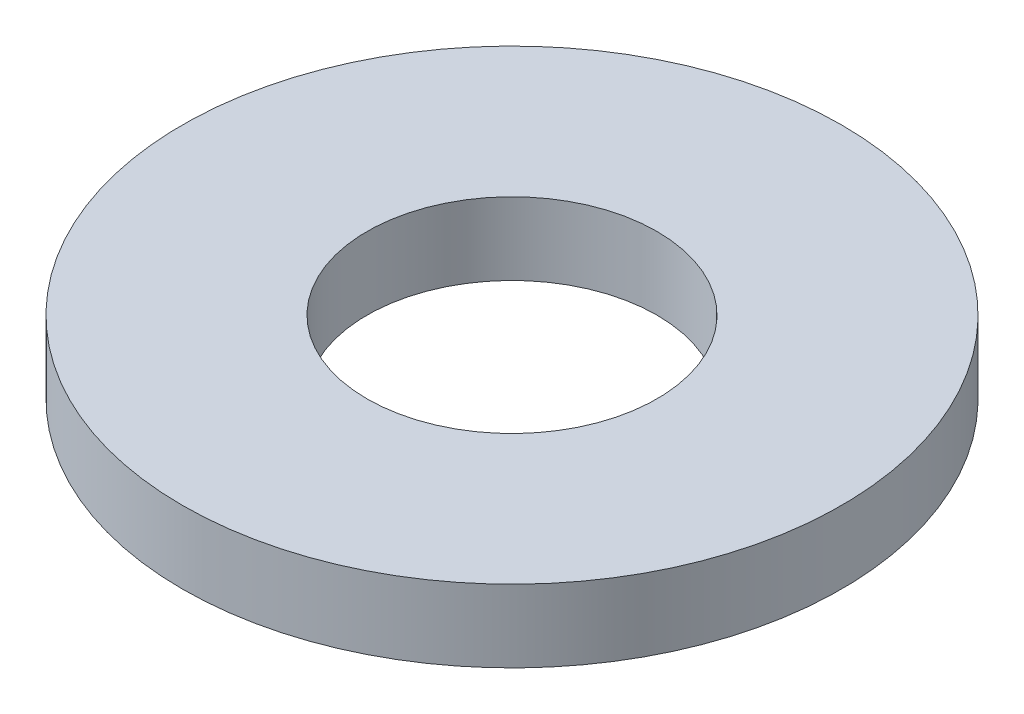
ISO-10303-21;
HEADER;
FILE_DESCRIPTION(('STEP AP214'),'2;1');
FILE_NAME('part.step','',(''),(''),'','','');
FILE_SCHEMA(('AUTOMOTIVE_DESIGN { 1 0 10303 214 1 1 1 1 }'));
ENDSEC;
DATA;
#1=APPLICATION_CONTEXT('core data for automotive mechanical design processes');
#2=APPLICATION_PROTOCOL_DEFINITION('international standard','automotive_design',2000,#1);
#3=PRODUCT_CONTEXT('',#1,'mechanical');
#4=PRODUCT('Part','Part','',(#3));
#5=PRODUCT_RELATED_PRODUCT_CATEGORY('part','',(#4));
#6=PRODUCT_DEFINITION_FORMATION('','',#4);
#7=PRODUCT_DEFINITION_CONTEXT('part definition',#1,'design');
#8=PRODUCT_DEFINITION('design','',#6,#7);
#9=PRODUCT_DEFINITION_SHAPE('','',#8);
#10=(LENGTH_UNIT() NAMED_UNIT(*) SI_UNIT(.MILLI.,.METRE.));
#11=(NAMED_UNIT(*) PLANE_ANGLE_UNIT() SI_UNIT($,.RADIAN.));
#12=(NAMED_UNIT(*) SI_UNIT($,.STERADIAN.) SOLID_ANGLE_UNIT());
#13=UNCERTAINTY_MEASURE_WITH_UNIT(LENGTH_MEASURE(1.E-05),#10,'distance_accuracy_value','');
#14=(GEOMETRIC_REPRESENTATION_CONTEXT(3) GLOBAL_UNCERTAINTY_ASSIGNED_CONTEXT((#13)) GLOBAL_UNIT_ASSIGNED_CONTEXT((#10,
#11,#12)) REPRESENTATION_CONTEXT('',''));
#15=CARTESIAN_POINT('',(0.,0.,0.));
#16=DIRECTION('',(0.,0.,1.));
#17=DIRECTION('',(1.,0.,0.));
#18=AXIS2_PLACEMENT_3D('',#15,#16,#17);
#19=CARTESIAN_POINT('',(0.,0.55,0.));
#20=DIRECTION('',(0.,1.,0.));
#21=DIRECTION('',(0.,0.,1.));
#22=AXIS2_PLACEMENT_3D('',#19,#20,#21);
#23=PLANE('',#22);
#24=CARTESIAN_POINT('',(0.,0.55,0.));
#25=DIRECTION('',(0.,1.,0.));
#26=DIRECTION('',(0.,0.,1.));
#27=AXIS2_PLACEMENT_3D('',#24,#25,#26);
#28=CIRCLE('',#27,2.5);
#29=CARTESIAN_POINT('',(0.,0.55,2.5));
#30=VERTEX_POINT('',#29);
#31=EDGE_CURVE('E10',#30,#30,#28,.T.);
#32=ORIENTED_EDGE('',*,*,#31,.T.);
#33=EDGE_LOOP('',(#32));
#34=FACE_BOUND('',#33,.T.);
#35=CARTESIAN_POINT('',(0.,0.55,0.));
#36=DIRECTION('',(0.,1.,0.));
#37=DIRECTION('',(0.,0.,1.));
#38=AXIS2_PLACEMENT_3D('',#35,#36,#37);
#39=CIRCLE('',#38,1.1);
#40=CARTESIAN_POINT('',(0.,0.55,1.1));
#41=VERTEX_POINT('',#40);
#42=EDGE_CURVE('E52',#41,#41,#39,.T.);
#43=ORIENTED_EDGE('',*,*,#42,.F.);
#44=EDGE_LOOP('',(#43));
#45=FACE_BOUND('',#44,.T.);
#46=ADVANCED_FACE('F39',(#34,#45),#23,.T.);
#47=CARTESIAN_POINT('',(0.,0.,0.));
#48=DIRECTION('',(0.,1.,0.));
#49=DIRECTION('',(0.,0.,1.));
#50=AXIS2_PLACEMENT_3D('',#47,#48,#49);
#51=PLANE('',#50);
#52=CARTESIAN_POINT('',(0.,0.,0.));
#53=DIRECTION('',(0.,1.,0.));
#54=DIRECTION('',(0.,0.,1.));
#55=AXIS2_PLACEMENT_3D('',#52,#53,#54);
#56=CIRCLE('',#55,2.5);
#57=CARTESIAN_POINT('',(0.,0.,2.5));
#58=VERTEX_POINT('',#57);
#59=EDGE_CURVE('E43',#58,#58,#56,.T.);
#60=ORIENTED_EDGE('',*,*,#59,.F.);
#61=EDGE_LOOP('',(#60));
#62=FACE_BOUND('',#61,.T.);
#63=CARTESIAN_POINT('',(0.,0.,0.));
#64=DIRECTION('',(0.,1.,0.));
#65=DIRECTION('',(0.,0.,1.));
#66=AXIS2_PLACEMENT_3D('',#63,#64,#65);
#67=CIRCLE('',#66,1.1);
#68=CARTESIAN_POINT('',(0.,0.,1.1));
#69=VERTEX_POINT('',#68);
#70=EDGE_CURVE('E54',#69,#69,#67,.T.);
#71=ORIENTED_EDGE('',*,*,#70,.T.);
#72=EDGE_LOOP('',(#71));
#73=FACE_BOUND('',#72,.T.);
#74=ADVANCED_FACE('F66',(#62,#73),#51,.F.);
#75=CARTESIAN_POINT('',(0.,0.55,0.));
#76=DIRECTION('',(0.,-1.,0.));
#77=DIRECTION('',(0.,0.,-1.));
#78=AXIS2_PLACEMENT_3D('',#75,#76,#77);
#79=CYLINDRICAL_SURFACE('',#78,2.5);
#80=ORIENTED_EDGE('',*,*,#31,.F.);
#81=EDGE_LOOP('',(#80));
#82=FACE_BOUND('',#81,.T.);
#83=ORIENTED_EDGE('',*,*,#59,.T.);
#84=EDGE_LOOP('',(#83));
#85=FACE_BOUND('',#84,.T.);
#86=ADVANCED_FACE('F41',(#82,#85),#79,.T.);
#87=CARTESIAN_POINT('',(0.,0.55,0.));
#88=DIRECTION('',(0.,-1.,0.));
#89=DIRECTION('',(0.,0.,-1.));
#90=AXIS2_PLACEMENT_3D('',#87,#88,#89);
#91=CYLINDRICAL_SURFACE('',#90,1.1);
#92=ORIENTED_EDGE('',*,*,#42,.T.);
#93=EDGE_LOOP('',(#92));
#94=FACE_BOUND('',#93,.T.);
#95=ORIENTED_EDGE('',*,*,#70,.F.);
#96=EDGE_LOOP('',(#95));
#97=FACE_BOUND('',#96,.T.);
#98=ADVANCED_FACE('F62',(#94,#97),#91,.F.);
#99=CLOSED_SHELL('',(#46,#74,#86,#98));
#100=MANIFOLD_SOLID_BREP('B2',#99);
#101=ADVANCED_BREP_SHAPE_REPRESENTATION('',(#18,#100),#14);
#102=SHAPE_DEFINITION_REPRESENTATION(#9,#101);
ENDSEC;
END-ISO-10303-21;
